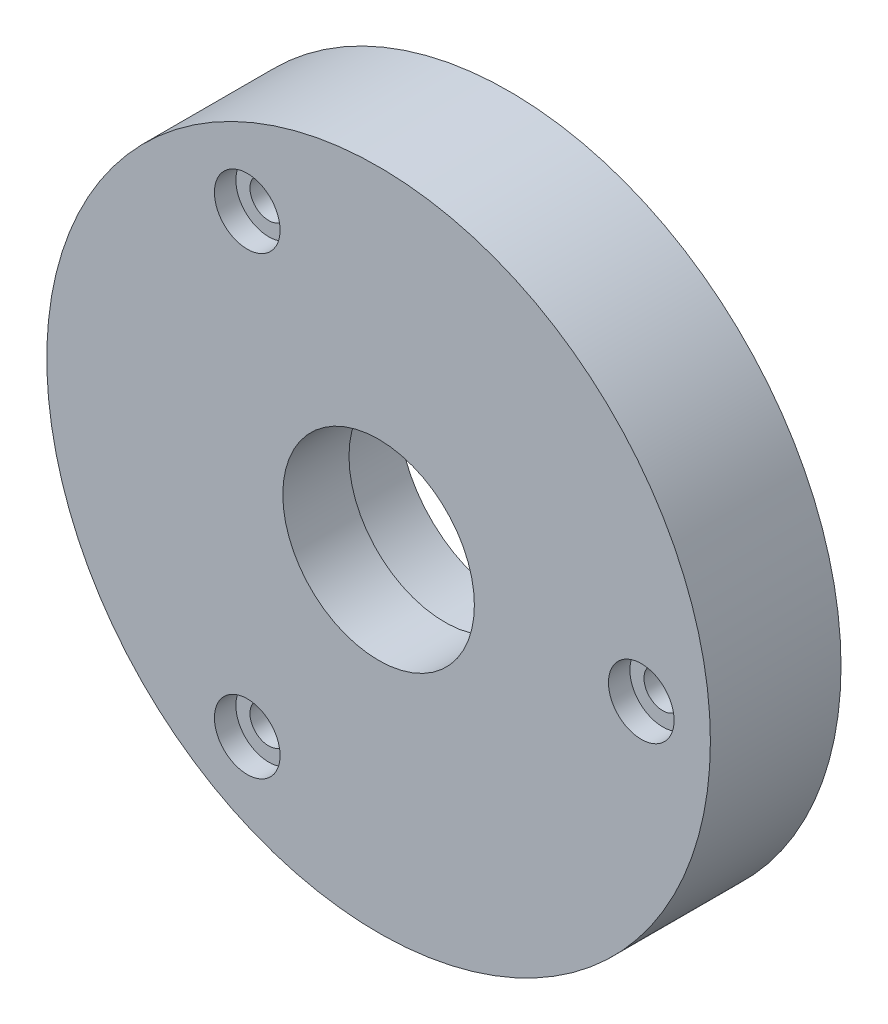
ISO-10303-21;
HEADER;
FILE_DESCRIPTION(('STEP AP214'),'2;1');
FILE_NAME('part.step','',(''),(''),'','','');
FILE_SCHEMA(('AUTOMOTIVE_DESIGN { 1 0 10303 214 1 1 1 1 }'));
ENDSEC;
DATA;
#1=APPLICATION_CONTEXT('core data for automotive mechanical design processes');
#2=APPLICATION_PROTOCOL_DEFINITION('international standard','automotive_design',2000,#1);
#3=PRODUCT_CONTEXT('',#1,'mechanical');
#4=PRODUCT('Part','Part','',(#3));
#5=PRODUCT_RELATED_PRODUCT_CATEGORY('part','',(#4));
#6=PRODUCT_DEFINITION_FORMATION('','',#4);
#7=PRODUCT_DEFINITION_CONTEXT('part definition',#1,'design');
#8=PRODUCT_DEFINITION('design','',#6,#7);
#9=PRODUCT_DEFINITION_SHAPE('','',#8);
#10=(LENGTH_UNIT() NAMED_UNIT(*) SI_UNIT(.MILLI.,.METRE.));
#11=(NAMED_UNIT(*) PLANE_ANGLE_UNIT() SI_UNIT($,.RADIAN.));
#12=(NAMED_UNIT(*) SI_UNIT($,.STERADIAN.) SOLID_ANGLE_UNIT());
#13=UNCERTAINTY_MEASURE_WITH_UNIT(LENGTH_MEASURE(1.E-05),#10,'distance_accuracy_value','');
#14=(GEOMETRIC_REPRESENTATION_CONTEXT(3) GLOBAL_UNCERTAINTY_ASSIGNED_CONTEXT((#13)) GLOBAL_UNIT_ASSIGNED_CONTEXT((#10,
#11,#12)) REPRESENTATION_CONTEXT('',''));
#15=CARTESIAN_POINT('',(0.,0.,0.));
#16=DIRECTION('',(0.,0.,1.));
#17=DIRECTION('',(1.,0.,0.));
#18=AXIS2_PLACEMENT_3D('',#15,#16,#17);
#19=CARTESIAN_POINT('',(23.0122911039965,8.43588789117605,15.));
#20=DIRECTION('',(0.,0.,-1.));
#21=DIRECTION('',(-1.,0.,0.));
#22=AXIS2_PLACEMENT_3D('',#19,#20,#21);
#23=CYLINDRICAL_SURFACE('',#22,11.);
#24=CARTESIAN_POINT('',(23.0122911039965,8.43588789117605,15.));
#25=DIRECTION('',(0.,0.,1.));
#26=DIRECTION('',(1.,0.,0.));
#27=AXIS2_PLACEMENT_3D('',#24,#25,#26);
#28=CIRCLE('',#27,11.);
#29=CARTESIAN_POINT('',(34.0122911039965,8.43588789117605,15.));
#30=VERTEX_POINT('',#29);
#31=EDGE_CURVE('E137',#30,#30,#28,.T.);
#32=ORIENTED_EDGE('',*,*,#31,.T.);
#33=EDGE_LOOP('',(#32));
#34=FACE_BOUND('',#33,.T.);
#35=CARTESIAN_POINT('',(23.0122911039965,8.43588789117605,7.4));
#36=DIRECTION('',(0.,0.,-1.));
#37=DIRECTION('',(-1.,0.,0.));
#38=AXIS2_PLACEMENT_3D('',#35,#36,#37);
#39=CIRCLE('',#38,11.);
#40=CARTESIAN_POINT('',(12.0122911039965,8.43588789117605,7.4));
#41=VERTEX_POINT('',#40);
#42=EDGE_CURVE('E43',#41,#41,#39,.T.);
#43=ORIENTED_EDGE('',*,*,#42,.T.);
#44=EDGE_LOOP('',(#43));
#45=FACE_BOUND('',#44,.T.);
#46=ADVANCED_FACE('F39',(#34,#45),#23,.F.);
#47=CARTESIAN_POINT('',(23.0122911039965,8.43588789117605,15.));
#48=DIRECTION('',(0.,0.,1.));
#49=DIRECTION('',(1.,0.,0.));
#50=AXIS2_PLACEMENT_3D('',#47,#48,#49);
#51=PLANE('',#50);
#52=CARTESIAN_POINT('',(7.93104110399675,34.5573791328243,15.));
#53=DIRECTION('',(0.,0.,1.));
#54=DIRECTION('',(1.,0.,0.));
#55=AXIS2_PLACEMENT_3D('',#52,#53,#54);
#56=CIRCLE('',#55,3.77062999999999);
#57=CARTESIAN_POINT('',(11.7016711039967,34.5573791328243,15.));
#58=VERTEX_POINT('',#57);
#59=EDGE_CURVE('E81',#58,#58,#56,.T.);
#60=ORIENTED_EDGE('',*,*,#59,.F.);
#61=EDGE_LOOP('',(#60));
#62=FACE_BOUND('',#61,.T.);
#63=CARTESIAN_POINT('',(53.1747911039965,8.43588789117605,15.));
#64=DIRECTION('',(0.,0.,1.));
#65=DIRECTION('',(1.,0.,0.));
#66=AXIS2_PLACEMENT_3D('',#63,#64,#65);
#67=CIRCLE('',#66,3.77063);
#68=CARTESIAN_POINT('',(56.9454211039965,8.43588789117605,15.));
#69=VERTEX_POINT('',#68);
#70=EDGE_CURVE('E86',#69,#69,#67,.T.);
#71=ORIENTED_EDGE('',*,*,#70,.F.);
#72=EDGE_LOOP('',(#71));
#73=FACE_BOUND('',#72,.T.);
#74=CARTESIAN_POINT('',(7.93104110399639,-17.685603350472,15.));
#75=DIRECTION('',(0.,0.,1.));
#76=DIRECTION('',(1.,0.,0.));
#77=AXIS2_PLACEMENT_3D('',#74,#75,#76);
#78=CIRCLE('',#77,3.77062999999999);
#79=CARTESIAN_POINT('',(11.7016711039964,-17.685603350472,15.));
#80=VERTEX_POINT('',#79);
#81=EDGE_CURVE('E102',#80,#80,#78,.T.);
#82=ORIENTED_EDGE('',*,*,#81,.F.);
#83=EDGE_LOOP('',(#82));
#84=FACE_BOUND('',#83,.T.);
#85=CARTESIAN_POINT('',(23.0122911039965,8.43588789117605,15.));
#86=DIRECTION('',(0.,0.,1.));
#87=DIRECTION('',(1.,0.,0.));
#88=AXIS2_PLACEMENT_3D('',#85,#86,#87);
#89=CIRCLE('',#88,38.1);
#90=CARTESIAN_POINT('',(61.1122911039965,8.43588789117605,15.));
#91=VERTEX_POINT('',#90);
#92=EDGE_CURVE('E11',#91,#91,#89,.T.);
#93=ORIENTED_EDGE('',*,*,#92,.T.);
#94=EDGE_LOOP('',(#93));
#95=FACE_BOUND('',#94,.T.);
#96=ORIENTED_EDGE('',*,*,#31,.F.);
#97=EDGE_LOOP('',(#96));
#98=FACE_BOUND('',#97,.T.);
#99=ADVANCED_FACE('F147',(#62,#73,#84,#95,#98),#51,.T.);
#100=CARTESIAN_POINT('',(23.0122911039965,8.43588789117605,0.));
#101=DIRECTION('',(0.,0.,1.));
#102=DIRECTION('',(1.,0.,0.));
#103=AXIS2_PLACEMENT_3D('',#100,#101,#102);
#104=PLANE('',#103);
#105=CARTESIAN_POINT('',(23.0122911039965,40.1858878911761,0.));
#106=DIRECTION('',(0.,0.,-1.));
#107=DIRECTION('',(-1.,0.,0.));
#108=AXIS2_PLACEMENT_3D('',#105,#106,#107);
#109=CIRCLE('',#108,1.5748);
#110=CARTESIAN_POINT('',(21.4374911039965,40.1858878911761,0.));
#111=VERTEX_POINT('',#110);
#112=EDGE_CURVE('E68',#111,#111,#109,.T.);
#113=ORIENTED_EDGE('',*,*,#112,.F.);
#114=EDGE_LOOP('',(#113));
#115=FACE_BOUND('',#114,.T.);
#116=CARTESIAN_POINT('',(33.8714306545866,-21.3993528187765,0.));
#117=DIRECTION('',(0.,0.,-1.));
#118=DIRECTION('',(-1.,0.,0.));
#119=AXIS2_PLACEMENT_3D('',#116,#117,#118);
#120=CIRCLE('',#119,1.5748);
#121=CARTESIAN_POINT('',(32.2966306545866,-21.3993528187765,0.));
#122=VERTEX_POINT('',#121);
#123=EDGE_CURVE('E67',#122,#122,#120,.T.);
#124=ORIENTED_EDGE('',*,*,#123,.F.);
#125=EDGE_LOOP('',(#124));
#126=FACE_BOUND('',#125,.T.);
#127=CARTESIAN_POINT('',(7.93104110399675,34.5573791328243,0.));
#128=DIRECTION('',(0.,0.,1.));
#129=DIRECTION('',(1.,0.,0.));
#130=AXIS2_PLACEMENT_3D('',#127,#128,#129);
#131=CIRCLE('',#130,2.15265);
#132=CARTESIAN_POINT('',(10.0836911039967,34.5573791328243,0.));
#133=VERTEX_POINT('',#132);
#134=EDGE_CURVE('E82',#133,#133,#131,.F.);
#135=ORIENTED_EDGE('',*,*,#134,.F.);
#136=EDGE_LOOP('',(#135));
#137=FACE_BOUND('',#136,.T.);
#138=CARTESIAN_POINT('',(53.1747911039965,8.43588789117605,0.));
#139=DIRECTION('',(0.,0.,1.));
#140=DIRECTION('',(1.,0.,0.));
#141=AXIS2_PLACEMENT_3D('',#138,#139,#140);
#142=CIRCLE('',#141,2.15265);
#143=CARTESIAN_POINT('',(55.3274411039965,8.43588789117605,0.));
#144=VERTEX_POINT('',#143);
#145=EDGE_CURVE('E98',#144,#144,#142,.F.);
#146=ORIENTED_EDGE('',*,*,#145,.F.);
#147=EDGE_LOOP('',(#146));
#148=FACE_BOUND('',#147,.T.);
#149=CARTESIAN_POINT('',(7.93104110399639,-17.685603350472,0.));
#150=DIRECTION('',(0.,0.,1.));
#151=DIRECTION('',(1.,0.,0.));
#152=AXIS2_PLACEMENT_3D('',#149,#150,#151);
#153=CIRCLE('',#152,2.15265);
#154=CARTESIAN_POINT('',(10.0836911039964,-17.685603350472,0.));
#155=VERTEX_POINT('',#154);
#156=EDGE_CURVE('E114',#155,#155,#153,.F.);
#157=ORIENTED_EDGE('',*,*,#156,.F.);
#158=EDGE_LOOP('',(#157));
#159=FACE_BOUND('',#158,.T.);
#160=CARTESIAN_POINT('',(23.0122911039965,8.43588789117605,0.));
#161=DIRECTION('',(0.,0.,-1.));
#162=DIRECTION('',(-1.,0.,0.));
#163=AXIS2_PLACEMENT_3D('',#160,#161,#162);
#164=CIRCLE('',#163,12.7);
#165=CARTESIAN_POINT('',(10.3122911039965,8.43588789117605,0.));
#166=VERTEX_POINT('',#165);
#167=EDGE_CURVE('E118',#166,#166,#164,.T.);
#168=ORIENTED_EDGE('',*,*,#167,.F.);
#169=EDGE_LOOP('',(#168));
#170=FACE_BOUND('',#169,.T.);
#171=CARTESIAN_POINT('',(23.0122911039965,8.43588789117605,0.));
#172=DIRECTION('',(0.,0.,1.));
#173=DIRECTION('',(1.,0.,0.));
#174=AXIS2_PLACEMENT_3D('',#171,#172,#173);
#175=CIRCLE('',#174,38.1);
#176=CARTESIAN_POINT('',(61.1122911039965,8.43588789117605,0.));
#177=VERTEX_POINT('',#176);
#178=EDGE_CURVE('E49',#177,#177,#175,.T.);
#179=ORIENTED_EDGE('',*,*,#178,.F.);
#180=EDGE_LOOP('',(#179));
#181=FACE_BOUND('',#180,.T.);
#182=ADVANCED_FACE('F145',(#115,#126,#137,#148,#159,#170,#181),#104,.F.);
#183=CARTESIAN_POINT('',(23.0122911039965,8.43588789117605,15.));
#184=DIRECTION('',(0.,0.,-1.));
#185=DIRECTION('',(-1.,0.,0.));
#186=AXIS2_PLACEMENT_3D('',#183,#184,#185);
#187=CYLINDRICAL_SURFACE('',#186,38.1);
#188=ORIENTED_EDGE('',*,*,#92,.F.);
#189=EDGE_LOOP('',(#188));
#190=FACE_BOUND('',#189,.T.);
#191=ORIENTED_EDGE('',*,*,#178,.T.);
#192=EDGE_LOOP('',(#191));
#193=FACE_BOUND('',#192,.T.);
#194=ADVANCED_FACE('F41',(#190,#193),#187,.T.);
#195=CARTESIAN_POINT('',(23.0122911039965,8.43588789117605,7.4));
#196=DIRECTION('',(0.,0.,-1.));
#197=DIRECTION('',(-1.,0.,0.));
#198=AXIS2_PLACEMENT_3D('',#195,#196,#197);
#199=CYLINDRICAL_SURFACE('',#198,12.7);
#200=CARTESIAN_POINT('',(23.0122911039965,8.43588789117605,7.4));
#201=DIRECTION('',(0.,0.,-1.));
#202=DIRECTION('',(-1.,0.,0.));
#203=AXIS2_PLACEMENT_3D('',#200,#201,#202);
#204=CIRCLE('',#203,12.7);
#205=CARTESIAN_POINT('',(10.3122911039965,8.43588789117605,7.4));
#206=VERTEX_POINT('',#205);
#207=EDGE_CURVE('E130',#206,#206,#204,.T.);
#208=ORIENTED_EDGE('',*,*,#207,.F.);
#209=EDGE_LOOP('',(#208));
#210=FACE_BOUND('',#209,.T.);
#211=ORIENTED_EDGE('',*,*,#167,.T.);
#212=EDGE_LOOP('',(#211));
#213=FACE_BOUND('',#212,.T.);
#214=ADVANCED_FACE('F153',(#210,#213),#199,.F.);
#215=CARTESIAN_POINT('',(23.0122911039965,8.43588789117605,7.4));
#216=DIRECTION('',(0.,0.,-1.));
#217=DIRECTION('',(-1.,0.,0.));
#218=AXIS2_PLACEMENT_3D('',#215,#216,#217);
#219=PLANE('',#218);
#220=ORIENTED_EDGE('',*,*,#42,.F.);
#221=EDGE_LOOP('',(#220));
#222=FACE_BOUND('',#221,.T.);
#223=ORIENTED_EDGE('',*,*,#207,.T.);
#224=EDGE_LOOP('',(#223));
#225=FACE_BOUND('',#224,.T.);
#226=ADVANCED_FACE('F168',(#222,#225),#219,.T.);
#227=CARTESIAN_POINT('',(7.93104110399639,-17.685603350472,15.));
#228=DIRECTION('',(0.,0.,1.));
#229=DIRECTION('',(1.,0.,0.));
#230=AXIS2_PLACEMENT_3D('',#227,#228,#229);
#231=CYLINDRICAL_SURFACE('',#230,2.15265);
#232=ORIENTED_EDGE('',*,*,#156,.T.);
#233=EDGE_LOOP('',(#232));
#234=FACE_BOUND('',#233,.T.);
#235=CARTESIAN_POINT('',(7.93104110399639,-17.685603350472,12.5362));
#236=DIRECTION('',(0.,0.,1.));
#237=DIRECTION('',(1.,0.,0.));
#238=AXIS2_PLACEMENT_3D('',#235,#236,#237);
#239=CIRCLE('',#238,2.15265);
#240=CARTESIAN_POINT('',(10.0836911039964,-17.685603350472,12.5362));
#241=VERTEX_POINT('',#240);
#242=EDGE_CURVE('E119',#241,#241,#239,.T.);
#243=ORIENTED_EDGE('',*,*,#242,.T.);
#244=EDGE_LOOP('',(#243));
#245=FACE_BOUND('',#244,.T.);
#246=ADVANCED_FACE('F172',(#234,#245),#231,.F.);
#247=CARTESIAN_POINT('',(10.0836911039964,-17.685603350472,12.5362));
#248=DIRECTION('',(0.,0.,-1.));
#249=DIRECTION('',(-1.,0.,0.));
#250=AXIS2_PLACEMENT_3D('',#247,#248,#249);
#251=PLANE('',#250);
#252=ORIENTED_EDGE('',*,*,#242,.F.);
#253=EDGE_LOOP('',(#252));
#254=FACE_BOUND('',#253,.T.);
#255=CARTESIAN_POINT('',(7.93104110399639,-17.685603350472,12.5362));
#256=DIRECTION('',(0.,0.,1.));
#257=DIRECTION('',(1.,0.,0.));
#258=AXIS2_PLACEMENT_3D('',#255,#256,#257);
#259=CIRCLE('',#258,3.77063);
#260=CARTESIAN_POINT('',(11.7016711039964,-17.685603350472,12.5362));
#261=VERTEX_POINT('',#260);
#262=EDGE_CURVE('E123',#261,#261,#259,.T.);
#263=ORIENTED_EDGE('',*,*,#262,.T.);
#264=EDGE_LOOP('',(#263));
#265=FACE_BOUND('',#264,.T.);
#266=ADVANCED_FACE('F176',(#254,#265),#251,.F.);
#267=CARTESIAN_POINT('',(7.93104110399639,-17.685603350472,15.));
#268=DIRECTION('',(0.,0.,1.));
#269=DIRECTION('',(1.,0.,0.));
#270=AXIS2_PLACEMENT_3D('',#267,#268,#269);
#271=CYLINDRICAL_SURFACE('',#270,3.77062999999999);
#272=ORIENTED_EDGE('',*,*,#262,.F.);
#273=EDGE_LOOP('',(#272));
#274=FACE_BOUND('',#273,.T.);
#275=ORIENTED_EDGE('',*,*,#81,.T.);
#276=EDGE_LOOP('',(#275));
#277=FACE_BOUND('',#276,.T.);
#278=ADVANCED_FACE('F180',(#274,#277),#271,.F.);
#279=CARTESIAN_POINT('',(53.1747911039965,8.43588789117605,15.));
#280=DIRECTION('',(0.,0.,1.));
#281=DIRECTION('',(1.,0.,0.));
#282=AXIS2_PLACEMENT_3D('',#279,#280,#281);
#283=CYLINDRICAL_SURFACE('',#282,2.15265);
#284=ORIENTED_EDGE('',*,*,#145,.T.);
#285=EDGE_LOOP('',(#284));
#286=FACE_BOUND('',#285,.T.);
#287=CARTESIAN_POINT('',(53.1747911039965,8.43588789117605,12.5362));
#288=DIRECTION('',(0.,0.,1.));
#289=DIRECTION('',(1.,0.,0.));
#290=AXIS2_PLACEMENT_3D('',#287,#288,#289);
#291=CIRCLE('',#290,2.15264999999999);
#292=CARTESIAN_POINT('',(55.3274411039965,8.43588789117605,12.5362));
#293=VERTEX_POINT('',#292);
#294=EDGE_CURVE('E103',#293,#293,#291,.T.);
#295=ORIENTED_EDGE('',*,*,#294,.T.);
#296=EDGE_LOOP('',(#295));
#297=FACE_BOUND('',#296,.T.);
#298=ADVANCED_FACE('F184',(#286,#297),#283,.F.);
#299=CARTESIAN_POINT('',(55.3274411039965,8.43588789117605,12.5362));
#300=DIRECTION('',(0.,0.,-1.));
#301=DIRECTION('',(-1.,0.,0.));
#302=AXIS2_PLACEMENT_3D('',#299,#300,#301);
#303=PLANE('',#302);
#304=ORIENTED_EDGE('',*,*,#294,.F.);
#305=EDGE_LOOP('',(#304));
#306=FACE_BOUND('',#305,.T.);
#307=CARTESIAN_POINT('',(53.1747911039965,8.43588789117605,12.5362));
#308=DIRECTION('',(0.,0.,1.));
#309=DIRECTION('',(1.,0.,0.));
#310=AXIS2_PLACEMENT_3D('',#307,#308,#309);
#311=CIRCLE('',#310,3.77063);
#312=CARTESIAN_POINT('',(56.9454211039965,8.43588789117605,12.5362));
#313=VERTEX_POINT('',#312);
#314=EDGE_CURVE('E107',#313,#313,#311,.T.);
#315=ORIENTED_EDGE('',*,*,#314,.T.);
#316=EDGE_LOOP('',(#315));
#317=FACE_BOUND('',#316,.T.);
#318=ADVANCED_FACE('F188',(#306,#317),#303,.F.);
#319=CARTESIAN_POINT('',(53.1747911039965,8.43588789117605,15.));
#320=DIRECTION('',(0.,0.,1.));
#321=DIRECTION('',(1.,0.,0.));
#322=AXIS2_PLACEMENT_3D('',#319,#320,#321);
#323=CYLINDRICAL_SURFACE('',#322,3.77063);
#324=ORIENTED_EDGE('',*,*,#314,.F.);
#325=EDGE_LOOP('',(#324));
#326=FACE_BOUND('',#325,.T.);
#327=ORIENTED_EDGE('',*,*,#70,.T.);
#328=EDGE_LOOP('',(#327));
#329=FACE_BOUND('',#328,.T.);
#330=ADVANCED_FACE('F192',(#326,#329),#323,.F.);
#331=CARTESIAN_POINT('',(7.93104110399675,34.5573791328243,15.));
#332=DIRECTION('',(0.,0.,1.));
#333=DIRECTION('',(1.,0.,0.));
#334=AXIS2_PLACEMENT_3D('',#331,#332,#333);
#335=CYLINDRICAL_SURFACE('',#334,2.15265);
#336=ORIENTED_EDGE('',*,*,#134,.T.);
#337=EDGE_LOOP('',(#336));
#338=FACE_BOUND('',#337,.T.);
#339=CARTESIAN_POINT('',(7.93104110399675,34.5573791328243,12.5362));
#340=DIRECTION('',(0.,0.,1.));
#341=DIRECTION('',(1.,0.,0.));
#342=AXIS2_PLACEMENT_3D('',#339,#340,#341);
#343=CIRCLE('',#342,2.15265);
#344=CARTESIAN_POINT('',(10.0836911039967,34.5573791328243,12.5362));
#345=VERTEX_POINT('',#344);
#346=EDGE_CURVE('E87',#345,#345,#343,.T.);
#347=ORIENTED_EDGE('',*,*,#346,.T.);
#348=EDGE_LOOP('',(#347));
#349=FACE_BOUND('',#348,.T.);
#350=ADVANCED_FACE('F196',(#338,#349),#335,.F.);
#351=CARTESIAN_POINT('',(10.0836911039967,34.5573791328243,12.5362));
#352=DIRECTION('',(0.,0.,-1.));
#353=DIRECTION('',(-1.,0.,0.));
#354=AXIS2_PLACEMENT_3D('',#351,#352,#353);
#355=PLANE('',#354);
#356=ORIENTED_EDGE('',*,*,#346,.F.);
#357=EDGE_LOOP('',(#356));
#358=FACE_BOUND('',#357,.T.);
#359=CARTESIAN_POINT('',(7.93104110399675,34.5573791328243,12.5362));
#360=DIRECTION('',(0.,0.,1.));
#361=DIRECTION('',(1.,0.,0.));
#362=AXIS2_PLACEMENT_3D('',#359,#360,#361);
#363=CIRCLE('',#362,3.77063);
#364=CARTESIAN_POINT('',(11.7016711039967,34.5573791328243,12.5362));
#365=VERTEX_POINT('',#364);
#366=EDGE_CURVE('E91',#365,#365,#363,.T.);
#367=ORIENTED_EDGE('',*,*,#366,.T.);
#368=EDGE_LOOP('',(#367));
#369=FACE_BOUND('',#368,.T.);
#370=ADVANCED_FACE('F200',(#358,#369),#355,.F.);
#371=CARTESIAN_POINT('',(7.93104110399675,34.5573791328243,15.));
#372=DIRECTION('',(0.,0.,1.));
#373=DIRECTION('',(1.,0.,0.));
#374=AXIS2_PLACEMENT_3D('',#371,#372,#373);
#375=CYLINDRICAL_SURFACE('',#374,3.77062999999999);
#376=ORIENTED_EDGE('',*,*,#366,.F.);
#377=EDGE_LOOP('',(#376));
#378=FACE_BOUND('',#377,.T.);
#379=ORIENTED_EDGE('',*,*,#59,.T.);
#380=EDGE_LOOP('',(#379));
#381=FACE_BOUND('',#380,.T.);
#382=ADVANCED_FACE('F204',(#378,#381),#375,.F.);
#383=CARTESIAN_POINT('',(33.8714306545866,-21.3993528187765,6.35));
#384=DIRECTION('',(0.,0.,-1.));
#385=DIRECTION('',(-1.,0.,0.));
#386=AXIS2_PLACEMENT_3D('',#383,#384,#385);
#387=CONICAL_SURFACE('',#386,1.5748,1.02974425867665);
#388=CARTESIAN_POINT('',(33.8714306545866,-21.3993528187765,7.2962353028446));
#389=VERTEX_POINT('',#388);
#390=VERTEX_LOOP('',#389);
#391=FACE_BOUND('',#390,.T.);
#392=CARTESIAN_POINT('',(33.8714306545866,-21.3993528187765,6.35));
#393=DIRECTION('',(0.,0.,-1.));
#394=DIRECTION('',(-1.,0.,0.));
#395=AXIS2_PLACEMENT_3D('',#392,#393,#394);
#396=CIRCLE('',#395,1.5748);
#397=CARTESIAN_POINT('',(32.2966306545866,-21.3993528187765,6.35));
#398=VERTEX_POINT('',#397);
#399=EDGE_CURVE('E73',#398,#398,#396,.T.);
#400=ORIENTED_EDGE('',*,*,#399,.T.);
#401=EDGE_LOOP('',(#400));
#402=FACE_BOUND('',#401,.T.);
#403=ADVANCED_FACE('F208',(#391,#402),#387,.F.);
#404=CARTESIAN_POINT('',(33.8714306545866,-21.3993528187765,0.));
#405=DIRECTION('',(0.,0.,-1.));
#406=DIRECTION('',(-1.,0.,0.));
#407=AXIS2_PLACEMENT_3D('',#404,#405,#406);
#408=CYLINDRICAL_SURFACE('',#407,1.5748);
#409=ORIENTED_EDGE('',*,*,#399,.F.);
#410=EDGE_LOOP('',(#409));
#411=FACE_BOUND('',#410,.T.);
#412=ORIENTED_EDGE('',*,*,#123,.T.);
#413=EDGE_LOOP('',(#412));
#414=FACE_BOUND('',#413,.T.);
#415=ADVANCED_FACE('F60',(#411,#414),#408,.F.);
#416=CARTESIAN_POINT('',(23.0122911039965,40.1858878911761,6.35));
#417=DIRECTION('',(0.,0.,-1.));
#418=DIRECTION('',(-1.,0.,0.));
#419=AXIS2_PLACEMENT_3D('',#416,#417,#418);
#420=CONICAL_SURFACE('',#419,1.5748,1.02974425867665);
#421=CARTESIAN_POINT('',(23.0122911039965,40.1858878911761,7.2962353028446));
#422=VERTEX_POINT('',#421);
#423=VERTEX_LOOP('',#422);
#424=FACE_BOUND('',#423,.T.);
#425=CARTESIAN_POINT('',(23.0122911039965,40.1858878911761,6.35));
#426=DIRECTION('',(0.,0.,-1.));
#427=DIRECTION('',(-1.,0.,0.));
#428=AXIS2_PLACEMENT_3D('',#425,#426,#427);
#429=CIRCLE('',#428,1.5748);
#430=CARTESIAN_POINT('',(21.4374911039965,40.1858878911761,6.35));
#431=VERTEX_POINT('',#430);
#432=EDGE_CURVE('E64',#431,#431,#429,.T.);
#433=ORIENTED_EDGE('',*,*,#432,.T.);
#434=EDGE_LOOP('',(#433));
#435=FACE_BOUND('',#434,.T.);
#436=ADVANCED_FACE('F56',(#424,#435),#420,.F.);
#437=CARTESIAN_POINT('',(23.0122911039965,40.1858878911761,0.));
#438=DIRECTION('',(0.,0.,-1.));
#439=DIRECTION('',(-1.,0.,0.));
#440=AXIS2_PLACEMENT_3D('',#437,#438,#439);
#441=CYLINDRICAL_SURFACE('',#440,1.5748);
#442=ORIENTED_EDGE('',*,*,#432,.F.);
#443=EDGE_LOOP('',(#442));
#444=FACE_BOUND('',#443,.T.);
#445=ORIENTED_EDGE('',*,*,#112,.T.);
#446=EDGE_LOOP('',(#445));
#447=FACE_BOUND('',#446,.T.);
#448=ADVANCED_FACE('F59',(#444,#447),#441,.F.);
#449=CLOSED_SHELL('',(#46,#99,#182,#194,#214,#226,#246,#266,#278,#298,#318,#330,#350,#370,#382,
#403,#415,#436,#448));
#450=MANIFOLD_SOLID_BREP('B2',#449);
#451=ADVANCED_BREP_SHAPE_REPRESENTATION('',(#18,#450),#14);
#452=SHAPE_DEFINITION_REPRESENTATION(#9,#451);
ENDSEC;
END-ISO-10303-21;
